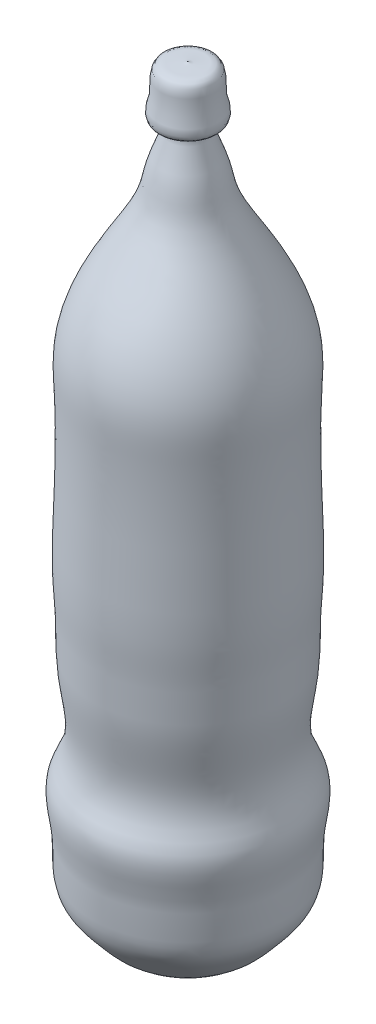
ISO-10303-21;
HEADER;
FILE_DESCRIPTION(('STEP AP214'),'2;1');
FILE_NAME('part.step','',(''),(''),'','','');
FILE_SCHEMA(('AUTOMOTIVE_DESIGN { 1 0 10303 214 1 1 1 1 }'));
ENDSEC;
DATA;
#1=APPLICATION_CONTEXT('core data for automotive mechanical design processes');
#2=APPLICATION_PROTOCOL_DEFINITION('international standard','automotive_design',2000,#1);
#3=PRODUCT_CONTEXT('',#1,'mechanical');
#4=PRODUCT('Part','Part','',(#3));
#5=PRODUCT_RELATED_PRODUCT_CATEGORY('part','',(#4));
#6=PRODUCT_DEFINITION_FORMATION('','',#4);
#7=PRODUCT_DEFINITION_CONTEXT('part definition',#1,'design');
#8=PRODUCT_DEFINITION('design','',#6,#7);
#9=PRODUCT_DEFINITION_SHAPE('','',#8);
#10=(LENGTH_UNIT() NAMED_UNIT(*) SI_UNIT(.MILLI.,.METRE.));
#11=(NAMED_UNIT(*) PLANE_ANGLE_UNIT() SI_UNIT($,.RADIAN.));
#12=(NAMED_UNIT(*) SI_UNIT($,.STERADIAN.) SOLID_ANGLE_UNIT());
#13=UNCERTAINTY_MEASURE_WITH_UNIT(LENGTH_MEASURE(1.E-05),#10,'distance_accuracy_value','');
#14=(GEOMETRIC_REPRESENTATION_CONTEXT(3) GLOBAL_UNCERTAINTY_ASSIGNED_CONTEXT((#13)) GLOBAL_UNIT_ASSIGNED_CONTEXT((#10,
#11,#12)) REPRESENTATION_CONTEXT('',''));
#15=CARTESIAN_POINT('',(0.,0.,0.));
#16=DIRECTION('',(0.,0.,1.));
#17=DIRECTION('',(1.,0.,0.));
#18=AXIS2_PLACEMENT_3D('',#15,#16,#17);
#19=CARTESIAN_POINT('',(0.,24.99042425651,-397.480925736693));
#20=CARTESIAN_POINT('',(0.,15.1786060984543,-406.136257748575));
#21=CARTESIAN_POINT('',(0.,15.7993429561419,-428.647560534745));
#22=CARTESIAN_POINT('',(0.,21.6032656961283,-451.58073249355));
#23=CARTESIAN_POINT('',(0.,28.6518162921917,-460.756257983894));
#24=CARTESIAN_POINT('',(0.,46.9385858326469,-475.966768828041));
#25=CARTESIAN_POINT('',(0.,67.1392453654863,-493.187134963676));
#26=CARTESIAN_POINT('',(0.,108.000465930221,-486.729493732581));
#27=CARTESIAN_POINT('',(0.,144.934171777437,-498.938451387041));
#28=CARTESIAN_POINT('',(0.,169.587391419871,-484.585989861215));
#29=CARTESIAN_POINT('',(0.,191.906396844931,-479.66162847468));
#30=CARTESIAN_POINT('',(0.,219.060531323631,-482.912597342717));
#31=CARTESIAN_POINT('',(0.,251.15637595236,-488.374789239096));
#32=CARTESIAN_POINT('',(0.,285.292903216021,-487.337175211328));
#33=CARTESIAN_POINT('',(0.,331.30231840216,-491.257105427241));
#34=CARTESIAN_POINT('',(0.,394.907694941811,-488.18077916559));
#35=CARTESIAN_POINT('',(0.,459.130193297153,-487.621951872736));
#36=CARTESIAN_POINT('',(0.,517.560331415892,-491.037757834509));
#37=CARTESIAN_POINT('',(0.,561.476913792999,-476.275680990011));
#38=CARTESIAN_POINT('',(0.,600.428115783667,-453.114960115707));
#39=CARTESIAN_POINT('',(0.,639.70666784139,-429.196798240167));
#40=CARTESIAN_POINT('',(0.,666.009986634435,-428.227882463616));
#41=CARTESIAN_POINT('',(0.,705.424393557824,-409.276978569958));
#42=CARTESIAN_POINT('',(0.,701.013469698546,-425.252058980321));
#43=CARTESIAN_POINT('',(0.,711.396270376683,-427.723381037426));
#44=CARTESIAN_POINT('',(0.,722.621059577752,-421.931417148335));
#45=CARTESIAN_POINT('',(0.,735.784682705897,-424.528358648375));
#46=CARTESIAN_POINT('',(0.,753.561422645364,-419.832769599974));
#47=CARTESIAN_POINT('',(0.,747.210844750898,-402.528848001123));
#48=CARTESIAN_POINT('',(0.,750.217626312893,-397.480925736693));
#49=B_SPLINE_CURVE_WITH_KNOTS('',3,(#19,#20,#21,#22,#23,#24,#25,#26,#27,#28,#29,#30,#31,#32,#33,
#34,#35,#36,#37,#38,#39,#40,#41,#42,#43,#44,#45,#46,#47,#48),.UNSPECIFIED.,.F.,.F.,(4,1,1,1,1,1,
1,1,1,1,1,1,1,1,1,1,1,1,1,1,1,1,1,1,1,1,1,4),(0.,0.0527174473212518,0.0615933246590792,
0.0887587733782735,0.102898763502246,0.131342265718408,0.186397137231301,0.237248028801273,
0.261378870191078,0.284282648549452,0.317845459148655,0.357762008039023,0.400412161290832,
0.439042856339057,0.522294800737515,0.626859589842,0.668482467058348,0.729840732977403,
0.786637080771353,0.834770464654657,0.880091715795651,0.911823575320685,0.917914728084053,
0.925646200983881,0.941175654384225,0.963532941826244,0.972206747163497,1.),.UNSPECIFIED.);
#50=CARTESIAN_POINT('',(0.,750.217626312893,-397.480925736693));
#51=DIRECTION('',(0.,1.,0.));
#52=AXIS1_PLACEMENT('',#50,#51);
#53=SURFACE_OF_REVOLUTION('',#49,#52);
#54=CARTESIAN_POINT('',(0.,750.217626312893,-397.480925736693));
#55=VERTEX_POINT('',#54);
#56=VERTEX_LOOP('',#55);
#57=FACE_BOUND('',#56,.T.);
#58=CARTESIAN_POINT('',(0.,24.99042425651,-397.480925736693));
#59=VERTEX_POINT('',#58);
#60=VERTEX_LOOP('',#59);
#61=FACE_BOUND('',#60,.T.);
#62=ADVANCED_FACE('F42',(#57,#61),#53,.T.);
#63=CLOSED_SHELL('',(#62));
#64=MANIFOLD_SOLID_BREP('B2',#63);
#65=ADVANCED_BREP_SHAPE_REPRESENTATION('',(#18,#64),#14);
#66=SHAPE_DEFINITION_REPRESENTATION(#9,#65);
ENDSEC;
END-ISO-10303-21;
